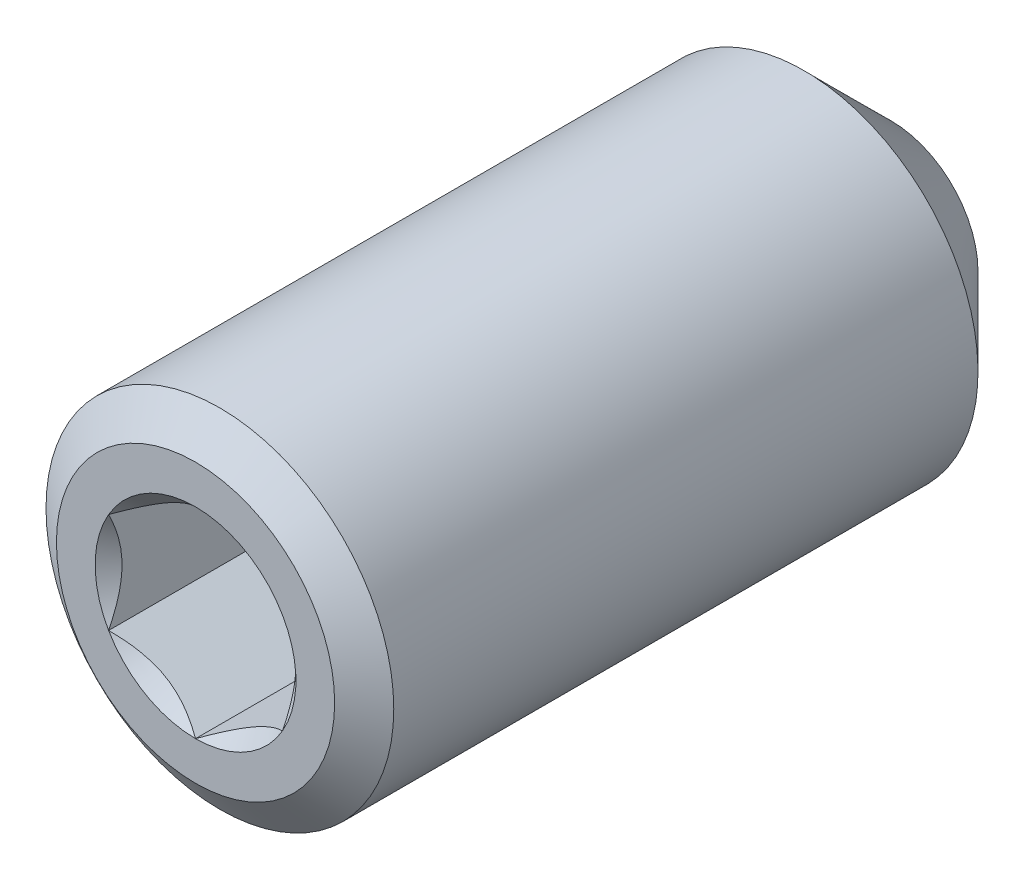
ISO-10303-21;
HEADER;
FILE_DESCRIPTION(('STEP AP214'),'2;1');
FILE_NAME('part.step','',(''),(''),'','','');
FILE_SCHEMA(('AUTOMOTIVE_DESIGN { 1 0 10303 214 1 1 1 1 }'));
ENDSEC;
DATA;
#1=APPLICATION_CONTEXT('core data for automotive mechanical design processes');
#2=APPLICATION_PROTOCOL_DEFINITION('international standard','automotive_design',2000,#1);
#3=PRODUCT_CONTEXT('',#1,'mechanical');
#4=PRODUCT('Part','Part','',(#3));
#5=PRODUCT_RELATED_PRODUCT_CATEGORY('part','',(#4));
#6=PRODUCT_DEFINITION_FORMATION('','',#4);
#7=PRODUCT_DEFINITION_CONTEXT('part definition',#1,'design');
#8=PRODUCT_DEFINITION('design','',#6,#7);
#9=PRODUCT_DEFINITION_SHAPE('','',#8);
#10=(LENGTH_UNIT() NAMED_UNIT(*) SI_UNIT(.MILLI.,.METRE.));
#11=(NAMED_UNIT(*) PLANE_ANGLE_UNIT() SI_UNIT($,.RADIAN.));
#12=(NAMED_UNIT(*) SI_UNIT($,.STERADIAN.) SOLID_ANGLE_UNIT());
#13=UNCERTAINTY_MEASURE_WITH_UNIT(LENGTH_MEASURE(1.E-05),#10,'distance_accuracy_value','');
#14=(GEOMETRIC_REPRESENTATION_CONTEXT(3) GLOBAL_UNCERTAINTY_ASSIGNED_CONTEXT((#13)) GLOBAL_UNIT_ASSIGNED_CONTEXT((#10,
#11,#12)) REPRESENTATION_CONTEXT('',''));
#15=CARTESIAN_POINT('',(0.,0.,0.));
#16=DIRECTION('',(0.,0.,1.));
#17=DIRECTION('',(1.,0.,0.));
#18=AXIS2_PLACEMENT_3D('',#15,#16,#17);
#19=CARTESIAN_POINT('',(0.,0.,4.50000000000727));
#20=DIRECTION('',(0.,0.,1.));
#21=DIRECTION('',(1.,0.,0.));
#22=AXIS2_PLACEMENT_3D('',#19,#20,#21);
#23=CONICAL_SURFACE('',#22,0.749999999925421,1.02974425866182);
#24=CARTESIAN_POINT('',(0.,0.,4.04935453576627));
#25=VERTEX_POINT('',#24);
#26=VERTEX_LOOP('',#25);
#27=FACE_BOUND('',#26,.T.);
#28=CARTESIAN_POINT('',(0.,0.,4.50000000000727));
#29=DIRECTION('',(0.,0.,1.));
#30=DIRECTION('',(1.,0.,0.));
#31=AXIS2_PLACEMENT_3D('',#28,#29,#30);
#32=CIRCLE('',#31,0.749999999925421);
#33=CARTESIAN_POINT('',(0.74999999996271,0.,4.50000000000338));
#34=VERTEX_POINT('',#33);
#35=CARTESIAN_POINT('',(0.374999999981353,-0.64951905280604,4.50000000000338));
#36=VERTEX_POINT('',#35);
#37=EDGE_CURVE('E132',#34,#36,#32,.F.);
#38=ORIENTED_EDGE('',*,*,#37,.F.);
#39=CARTESIAN_POINT('',(0.,0.,4.50000000000727));
#40=DIRECTION('',(0.,0.,1.));
#41=DIRECTION('',(1.,0.,0.));
#42=AXIS2_PLACEMENT_3D('',#39,#40,#41);
#43=CIRCLE('',#42,0.749999999925421);
#44=CARTESIAN_POINT('',(0.374999999981358,0.649519052806031,4.50000000000338));
#45=VERTEX_POINT('',#44);
#46=EDGE_CURVE('E150',#45,#34,#43,.F.);
#47=ORIENTED_EDGE('',*,*,#46,.F.);
#48=CARTESIAN_POINT('',(0.,0.,4.50000000000727));
#49=DIRECTION('',(0.,0.,1.));
#50=DIRECTION('',(1.,0.,0.));
#51=AXIS2_PLACEMENT_3D('',#48,#49,#50);
#52=CIRCLE('',#51,0.749999999925421);
#53=CARTESIAN_POINT('',(-0.374999999981358,0.649519052806032,4.50000000000338));
#54=VERTEX_POINT('',#53);
#55=EDGE_CURVE('E223',#54,#45,#52,.F.);
#56=ORIENTED_EDGE('',*,*,#55,.F.);
#57=CARTESIAN_POINT('',(0.,0.,4.50000000000727));
#58=DIRECTION('',(0.,0.,1.));
#59=DIRECTION('',(1.,0.,0.));
#60=AXIS2_PLACEMENT_3D('',#57,#58,#59);
#61=CIRCLE('',#60,0.749999999925421);
#62=CARTESIAN_POINT('',(-0.749999999962711,0.,4.50000000000338));
#63=VERTEX_POINT('',#62);
#64=EDGE_CURVE('E112',#63,#54,#61,.F.);
#65=ORIENTED_EDGE('',*,*,#64,.F.);
#66=CARTESIAN_POINT('',(0.,0.,4.50000000000727));
#67=DIRECTION('',(0.,0.,1.));
#68=DIRECTION('',(1.,0.,0.));
#69=AXIS2_PLACEMENT_3D('',#66,#67,#68);
#70=CIRCLE('',#69,0.749999999925421);
#71=CARTESIAN_POINT('',(-0.374999999981354,-0.649519052806039,4.50000000000338));
#72=VERTEX_POINT('',#71);
#73=EDGE_CURVE('E106',#72,#63,#70,.F.);
#74=ORIENTED_EDGE('',*,*,#73,.F.);
#75=CARTESIAN_POINT('',(0.,0.,4.50000000000727));
#76=DIRECTION('',(0.,0.,1.));
#77=DIRECTION('',(1.,0.,0.));
#78=AXIS2_PLACEMENT_3D('',#75,#76,#77);
#79=CIRCLE('',#78,0.749999999925421);
#80=EDGE_CURVE('E109',#36,#72,#79,.F.);
#81=ORIENTED_EDGE('',*,*,#80,.F.);
#82=EDGE_LOOP('',(#38,#47,#56,#65,#74,#81));
#83=FACE_BOUND('',#82,.T.);
#84=ADVANCED_FACE('F36',(#27,#83),#23,.F.);
#85=CARTESIAN_POINT('',(0.,0.866025403784442,4.49999999999948));
#86=DIRECTION('',(0.,0.,1.));
#87=DIRECTION('',(1.,0.,0.));
#88=AXIS2_PLACEMENT_3D('',#85,#86,#87);
#89=PLANE('',#88);
#90=DIRECTION('',(0.,-1.,0.));
#91=VECTOR('',#90,1.);
#92=CARTESIAN_POINT('',(-0.75,0.433012701892223,4.49999999999948));
#93=LINE('',#92,#91);
#94=CARTESIAN_POINT('',(-0.750000000000009,-0.433012701892209,4.49999999999948));
#95=VERTEX_POINT('',#94);
#96=EDGE_CURVE('E119',#63,#95,#93,.T.);
#97=ORIENTED_EDGE('',*,*,#96,.T.);
#98=DIRECTION('',(0.866025403784438,-0.500000000000001,0.));
#99=VECTOR('',#98,1.);
#100=CARTESIAN_POINT('',(-0.75,-0.433012701892216,4.49999999999948));
#101=LINE('',#100,#99);
#102=EDGE_CURVE('E117',#95,#72,#101,.T.);
#103=ORIENTED_EDGE('',*,*,#102,.T.);
#104=ORIENTED_EDGE('',*,*,#73,.T.);
#105=EDGE_LOOP('',(#97,#103,#104));
#106=FACE_BOUND('',#105,.T.);
#107=ADVANCED_FACE('F118',(#106),#89,.T.);
#108=CARTESIAN_POINT('',(0.,0.866025403784442,4.49999999999948));
#109=DIRECTION('',(0.,0.,1.));
#110=DIRECTION('',(1.,0.,0.));
#111=AXIS2_PLACEMENT_3D('',#108,#109,#110);
#112=PLANE('',#111);
#113=DIRECTION('',(0.866025403784438,-0.500000000000001,0.));
#114=VECTOR('',#113,1.);
#115=CARTESIAN_POINT('',(-0.75,-0.433012701892216,4.49999999999948));
#116=LINE('',#115,#114);
#117=CARTESIAN_POINT('',(0.,-0.86602540378444,4.49999999999948));
#118=VERTEX_POINT('',#117);
#119=EDGE_CURVE('E124',#72,#118,#116,.T.);
#120=ORIENTED_EDGE('',*,*,#119,.T.);
#121=DIRECTION('',(0.866025403784439,0.5,0.));
#122=VECTOR('',#121,1.);
#123=CARTESIAN_POINT('',(0.,-0.866025403784436,4.49999999999948));
#124=LINE('',#123,#122);
#125=EDGE_CURVE('E130',#118,#36,#124,.T.);
#126=ORIENTED_EDGE('',*,*,#125,.T.);
#127=ORIENTED_EDGE('',*,*,#80,.T.);
#128=EDGE_LOOP('',(#120,#126,#127));
#129=FACE_BOUND('',#128,.T.);
#130=ADVANCED_FACE('F127',(#129),#112,.T.);
#131=CARTESIAN_POINT('',(0.,0.866025403784442,4.49999999999948));
#132=DIRECTION('',(0.,0.,1.));
#133=DIRECTION('',(1.,0.,0.));
#134=AXIS2_PLACEMENT_3D('',#131,#132,#133);
#135=PLANE('',#134);
#136=DIRECTION('',(0.866025403784439,0.5,0.));
#137=VECTOR('',#136,1.);
#138=CARTESIAN_POINT('',(0.,-0.866025403784436,4.49999999999948));
#139=LINE('',#138,#137);
#140=CARTESIAN_POINT('',(0.749999999999999,-0.433012701892217,4.49999999999948));
#141=VERTEX_POINT('',#140);
#142=EDGE_CURVE('E145',#36,#141,#139,.T.);
#143=ORIENTED_EDGE('',*,*,#142,.T.);
#144=DIRECTION('',(0.,1.,0.));
#145=VECTOR('',#144,1.);
#146=CARTESIAN_POINT('',(0.749999999999999,-0.433012701892217,4.49999999999948));
#147=LINE('',#146,#145);
#148=EDGE_CURVE('E146',#141,#34,#147,.T.);
#149=ORIENTED_EDGE('',*,*,#148,.T.);
#150=ORIENTED_EDGE('',*,*,#37,.T.);
#151=EDGE_LOOP('',(#143,#149,#150));
#152=FACE_BOUND('',#151,.T.);
#153=ADVANCED_FACE('F237',(#152),#135,.T.);
#154=CARTESIAN_POINT('',(0.,0.866025403784442,4.49999999999948));
#155=DIRECTION('',(0.,0.,1.));
#156=DIRECTION('',(1.,0.,0.));
#157=AXIS2_PLACEMENT_3D('',#154,#155,#156);
#158=PLANE('',#157);
#159=DIRECTION('',(0.,1.,0.));
#160=VECTOR('',#159,1.);
#161=CARTESIAN_POINT('',(0.749999999999999,-0.433012701892217,4.49999999999948));
#162=LINE('',#161,#160);
#163=CARTESIAN_POINT('',(0.750000000000007,0.433012701892215,4.49999999999948));
#164=VERTEX_POINT('',#163);
#165=EDGE_CURVE('E149',#34,#164,#162,.T.);
#166=ORIENTED_EDGE('',*,*,#165,.T.);
#167=DIRECTION('',(-0.866025403784438,0.5,0.));
#168=VECTOR('',#167,1.);
#169=CARTESIAN_POINT('',(0.749999999999999,0.433012701892222,4.49999999999948));
#170=LINE('',#169,#168);
#171=EDGE_CURVE('E142',#164,#45,#170,.T.);
#172=ORIENTED_EDGE('',*,*,#171,.T.);
#173=ORIENTED_EDGE('',*,*,#46,.T.);
#174=EDGE_LOOP('',(#166,#172,#173));
#175=FACE_BOUND('',#174,.T.);
#176=ADVANCED_FACE('F232',(#175),#158,.T.);
#177=CARTESIAN_POINT('',(0.749999999999999,-0.433012701892217,4.49999999999948));
#178=DIRECTION('',(1.,0.,0.));
#179=DIRECTION('',(0.,1.,0.));
#180=AXIS2_PLACEMENT_3D('',#177,#178,#179);
#181=PLANE('',#180);
#182=CARTESIAN_POINT('',(0.749999999995906,0.433012701914364,5.99999999996046));
#183=CARTESIAN_POINT('',(0.749999999998594,0.403441408888391,5.98522820573675));
#184=CARTESIAN_POINT('',(0.749999999999638,0.37337887783879,5.97131887836901));
#185=CARTESIAN_POINT('',(0.750000000000363,0.312066927955883,5.94582279647847));
#186=CARTESIAN_POINT('',(0.750000000000036,0.280811134179813,5.93425150803452));
#187=CARTESIAN_POINT('',(0.749999999999962,0.217396113243469,5.91427050126752));
#188=CARTESIAN_POINT('',(0.750000000000214,0.18524034957555,5.90585008318148));
#189=CARTESIAN_POINT('',(0.749999999999784,0.12022426110021,5.89288602800046));
#190=CARTESIAN_POINT('',(0.749999999999105,0.0873664415698819,5.88833040254721));
#191=CARTESIAN_POINT('',(0.750000000000244,0.0453234331292911,5.88528812566378));
#192=CARTESIAN_POINT('',(0.750000000000608,0.0362631205459866,5.88479639312832));
#193=CARTESIAN_POINT('',(0.749999999999391,0.0181361518266818,5.88413890227256));
#194=CARTESIAN_POINT('',(0.749999999997811,0.00906950181756283,5.88397296687396));
#195=CARTESIAN_POINT('',(0.749999999991179,-0.0454965876522435,5.88398276973582));
#196=CARTESIAN_POINT('',(0.749999999997652,-0.0910649400477444,5.8882076503569));
#197=CARTESIAN_POINT('',(0.750000000002359,-0.180995263452349,5.90421405985006));
#198=CARTESIAN_POINT('',(0.750000000000548,-0.225349278846379,5.91603676749379));
#199=CARTESIAN_POINT('',(0.749999999999641,-0.297034326914572,5.94020960252143));
#200=CARTESIAN_POINT('',(0.749999999999821,-0.324935648342745,5.950955654539));
#201=CARTESIAN_POINT('',(0.750000000000176,-0.379681856888471,5.97424598413838));
#202=CARTESIAN_POINT('',(0.750000000000351,-0.406534072509005,5.98677291522191));
#203=CARTESIAN_POINT('',(0.749999999999999,-0.433012701915036,5.99999999995856));
#204=B_SPLINE_CURVE_WITH_KNOTS('',3,(#182,#183,#184,#185,#186,#187,#188,#189,#190,#191,#192,
#193,#194,#195,#196,#197,#198,#199,#200,#201,#202,#203),.UNSPECIFIED.,.F.,.F.,(4,2,2,2,2,2,2,2,
2,2,4),(0.,0.0992348996301591,0.199106167923932,0.298635146301185,0.397854250906614,
0.425070686719632,0.452272325669632,0.588727643245865,0.725928832123817,0.815560498237236,
0.904372346970106),.UNSPECIFIED.);
#205=CARTESIAN_POINT('',(0.750000000021348,0.433012701891416,5.99999999996524));
#206=VERTEX_POINT('',#205);
#207=CARTESIAN_POINT('',(0.750000000009975,-0.433012701897992,5.99999999995868));
#208=VERTEX_POINT('',#207);
#209=EDGE_CURVE('E215',#206,#208,#204,.T.);
#210=ORIENTED_EDGE('',*,*,#209,.F.);
#211=DIRECTION('',(0.,0.,1.));
#212=VECTOR('',#211,1.);
#213=CARTESIAN_POINT('',(0.750000000000011,0.433012701892215,4.49999999999948));
#214=LINE('',#213,#212);
#215=EDGE_CURVE('E285',#206,#164,#214,.F.);
#216=ORIENTED_EDGE('',*,*,#215,.T.);
#217=ORIENTED_EDGE('',*,*,#165,.F.);
#218=ORIENTED_EDGE('',*,*,#148,.F.);
#219=DIRECTION('',(0.,0.,1.));
#220=VECTOR('',#219,1.);
#221=CARTESIAN_POINT('',(0.749999999999999,-0.433012701892217,4.49999999999948));
#222=LINE('',#221,#220);
#223=EDGE_CURVE('E152',#141,#208,#222,.T.);
#224=ORIENTED_EDGE('',*,*,#223,.T.);
#225=EDGE_LOOP('',(#210,#216,#217,#218,#224));
#226=FACE_BOUND('',#225,.T.);
#227=ADVANCED_FACE('F226',(#226),#181,.F.);
#228=CARTESIAN_POINT('',(0.,0.866025403784442,4.49999999999948));
#229=DIRECTION('',(0.,0.,1.));
#230=DIRECTION('',(1.,0.,0.));
#231=AXIS2_PLACEMENT_3D('',#228,#229,#230);
#232=PLANE('',#231);
#233=DIRECTION('',(-0.866025403784438,0.5,0.));
#234=VECTOR('',#233,1.);
#235=CARTESIAN_POINT('',(0.749999999999999,0.433012701892222,4.49999999999948));
#236=LINE('',#235,#234);
#237=CARTESIAN_POINT('',(0.,0.866025403784442,4.49999999999948));
#238=VERTEX_POINT('',#237);
#239=EDGE_CURVE('E289',#45,#238,#236,.T.);
#240=ORIENTED_EDGE('',*,*,#239,.T.);
#241=DIRECTION('',(-0.866025403784439,-0.5,0.));
#242=VECTOR('',#241,1.);
#243=CARTESIAN_POINT('',(0.,0.866025403784442,4.49999999999948));
#244=LINE('',#243,#242);
#245=EDGE_CURVE('E288',#238,#54,#244,.T.);
#246=ORIENTED_EDGE('',*,*,#245,.T.);
#247=ORIENTED_EDGE('',*,*,#55,.T.);
#248=EDGE_LOOP('',(#240,#246,#247));
#249=FACE_BOUND('',#248,.T.);
#250=ADVANCED_FACE('F231',(#249),#232,.T.);
#251=CARTESIAN_POINT('',(0.,0.866025403784442,4.49999999999948));
#252=DIRECTION('',(0.,0.,1.));
#253=DIRECTION('',(1.,0.,0.));
#254=AXIS2_PLACEMENT_3D('',#251,#252,#253);
#255=PLANE('',#254);
#256=DIRECTION('',(-0.866025403784439,-0.5,0.));
#257=VECTOR('',#256,1.);
#258=CARTESIAN_POINT('',(0.,0.866025403784442,4.49999999999948));
#259=LINE('',#258,#257);
#260=CARTESIAN_POINT('',(-0.75,0.433012701892223,4.49999999999948));
#261=VERTEX_POINT('',#260);
#262=EDGE_CURVE('E284',#54,#261,#259,.T.);
#263=ORIENTED_EDGE('',*,*,#262,.T.);
#264=DIRECTION('',(0.,-1.,0.));
#265=VECTOR('',#264,1.);
#266=CARTESIAN_POINT('',(-0.75,0.433012701892223,4.49999999999948));
#267=LINE('',#266,#265);
#268=EDGE_CURVE('E153',#261,#63,#267,.T.);
#269=ORIENTED_EDGE('',*,*,#268,.T.);
#270=ORIENTED_EDGE('',*,*,#64,.T.);
#271=EDGE_LOOP('',(#263,#269,#270));
#272=FACE_BOUND('',#271,.T.);
#273=ADVANCED_FACE('F362',(#272),#255,.T.);
#274=CARTESIAN_POINT('',(-0.75,0.433012701892223,4.49999999999948));
#275=DIRECTION('',(-1.,0.,0.));
#276=DIRECTION('',(0.,-1.,0.));
#277=AXIS2_PLACEMENT_3D('',#274,#275,#276);
#278=PLANE('',#277);
#279=CARTESIAN_POINT('',(-0.749999999999923,0.433012701922721,5.99999999996244));
#280=CARTESIAN_POINT('',(-0.749999999999973,0.403246944989505,5.98513147472453));
#281=CARTESIAN_POINT('',(-0.749999999999993,0.372983565897345,5.97113627517712));
#282=CARTESIAN_POINT('',(-0.750000000000008,0.311273429792204,5.94551165761261));
#283=CARTESIAN_POINT('',(-0.750000000000002,0.279820807346284,5.93389649243577));
#284=CARTESIAN_POINT('',(-0.749999999999998,0.216398013159877,5.91399978020333));
#285=CARTESIAN_POINT('',(-0.75,0.184443986521106,5.90566823436392));
#286=CARTESIAN_POINT('',(-0.750000000000001,0.119833147118933,5.89283136511692));
#287=CARTESIAN_POINT('',(-0.75,0.087178305495629,5.88831646481291));
#288=CARTESIAN_POINT('',(-0.75,0.0308931041092522,5.88424416349984));
#289=CARTESIAN_POINT('',(-0.75,0.00733583721429635,5.88364242512977));
#290=CARTESIAN_POINT('',(-0.75,-0.0397329932701554,5.88465658474378));
#291=CARTESIAN_POINT('',(-0.75,-0.0632445456151731,5.88627297259746));
#292=CARTESIAN_POINT('',(-0.75,-0.133443280558879,5.89434248970702));
#293=CARTESIAN_POINT('',(-0.75,-0.1797810172061,5.90401688109026));
#294=CARTESIAN_POINT('',(-0.75,-0.261074390585046,5.92735326039503));
#295=CARTESIAN_POINT('',(-0.75,-0.296412671254379,5.93978774074377));
#296=CARTESIAN_POINT('',(-0.75,-0.36570624571498,5.96779596368077));
#297=CARTESIAN_POINT('',(-0.75,-0.399665619763367,5.98335948719142));
#298=CARTESIAN_POINT('',(-0.75,-0.433012701922693,5.99999999996239));
#299=B_SPLINE_CURVE_WITH_KNOTS('',3,(#279,#280,#281,#282,#283,#284,#285,#286,#287,#288,#289,
#290,#291,#292,#293,#294,#295,#296,#297,#298),.UNSPECIFIED.,.F.,.F.,(4,2,2,2,2,2,2,2,2,4),(0.,
0.0998872099427302,0.200356156114305,0.299229995132668,0.397854992805662,0.468447345365128,
0.539055290641225,0.680311200470284,0.792547810023111,0.904423654744535),.UNSPECIFIED.);
#300=CARTESIAN_POINT('',(-0.75,0.433012701892222,5.9999999999879));
#301=VERTEX_POINT('',#300);
#302=CARTESIAN_POINT('',(-0.750000000070577,-0.43301270186671,5.99999999999552));
#303=VERTEX_POINT('',#302);
#304=EDGE_CURVE('E281',#301,#303,#299,.T.);
#305=ORIENTED_EDGE('',*,*,#304,.T.);
#306=DIRECTION('',(0.,0.,1.));
#307=VECTOR('',#306,1.);
#308=CARTESIAN_POINT('',(-0.750000000000013,-0.433012701892209,4.49999999999948));
#309=LINE('',#308,#307);
#310=EDGE_CURVE('E137',#303,#95,#309,.F.);
#311=ORIENTED_EDGE('',*,*,#310,.T.);
#312=ORIENTED_EDGE('',*,*,#96,.F.);
#313=ORIENTED_EDGE('',*,*,#268,.F.);
#314=DIRECTION('',(0.,0.,1.));
#315=VECTOR('',#314,1.);
#316=CARTESIAN_POINT('',(-0.75,0.433012701892222,4.49999999999948));
#317=LINE('',#316,#315);
#318=EDGE_CURVE('E282',#261,#301,#317,.T.);
#319=ORIENTED_EDGE('',*,*,#318,.T.);
#320=EDGE_LOOP('',(#305,#311,#312,#313,#319));
#321=FACE_BOUND('',#320,.T.);
#322=ADVANCED_FACE('F323',(#321),#278,.F.);
#323=CARTESIAN_POINT('',(-0.75,-0.433012701892216,4.49999999999948));
#324=DIRECTION('',(-0.500000000000001,-0.866025403784438,0.));
#325=DIRECTION('',(0.866025403784438,-0.500000000000001,0.));
#326=AXIS2_PLACEMENT_3D('',#323,#324,#325);
#327=PLANE('',#326);
#328=CARTESIAN_POINT('',(-0.750000000026376,-0.433012701876903,5.99999999996244));
#329=CARTESIAN_POINT('',(-0.724222098348532,-0.447895580349805,5.9851314747255));
#330=CARTESIAN_POINT('',(-0.698013243239477,-0.463027269902192,5.97113627517958));
#331=CARTESIAN_POINT('',(-0.644570697679657,-0.493882337967349,5.94551165761944));
#332=CARTESIAN_POINT('',(-0.617331927614965,-0.509608649196587,5.93389649244547));
#333=CARTESIAN_POINT('',(-0.562406176649344,-0.541320046302027,5.91399978022048));
#334=CARTESIAN_POINT('',(-0.534733177816652,-0.557297059627367,5.90566823438559));
#335=CARTESIAN_POINT('',(-0.478778549514438,-0.589602479340057,5.89283136514922));
#336=CARTESIAN_POINT('',(-0.450498627102313,-0.605929900157359,5.8883164648513));
#337=CARTESIAN_POINT('',(-0.401754212821907,-0.634072500863641,5.88424416354908));
#338=CARTESIAN_POINT('',(-0.38135302123402,-0.645851134318697,5.8836424251842));
#339=CARTESIAN_POINT('',(-0.340590218282302,-0.669385549575796,5.88465658481027));
#340=CARTESIAN_POINT('',(-0.320228616656475,-0.681141325755599,5.88627297267082));
#341=CARTESIAN_POINT('',(-0.25943472884466,-0.716240693248834,5.89434248980279));
#342=CARTESIAN_POINT('',(-0.219305071730786,-0.739409561586017,5.90401688120336));
#343=CARTESIAN_POINT('',(-0.14890294525298,-0.7800562482595,5.92735326051767));
#344=CARTESIAN_POINT('',(-0.118299096515651,-0.797725388566235,5.9397877408492));
#345=CARTESIAN_POINT('',(-0.058289100806435,-0.83237217574302,5.96779596373976));
#346=CARTESIAN_POINT('',(-0.0288794202282302,-0.849351862741627,5.98335948722117));
#347=CARTESIAN_POINT('',(2.18249680749525E-11,-0.866025403797037,5.99999999995975));
#348=B_SPLINE_CURVE_WITH_KNOTS('',3,(#328,#329,#330,#331,#332,#333,#334,#335,#336,#337,#338,
#339,#340,#341,#342,#343,#344,#345,#346,#347),.UNSPECIFIED.,.F.,.F.,(4,2,2,2,2,2,2,2,2,4),(0.,
0.0998872099750245,0.200356156178901,0.299229995228299,0.397854992932302,0.468447345536717,
0.539055290857816,0.680311200776961,0.792547810155694,0.904423654702465),.UNSPECIFIED.);
#349=CARTESIAN_POINT('',(-1.03375332118698E-11,-0.866025403803119,5.99999999996583));
#350=VERTEX_POINT('',#349);
#351=EDGE_CURVE('E318',#303,#350,#348,.T.);
#352=ORIENTED_EDGE('',*,*,#351,.T.);
#353=DIRECTION('',(0.,0.,1.));
#354=VECTOR('',#353,1.);
#355=CARTESIAN_POINT('',(0.,-0.866025403784444,4.49999999999948));
#356=LINE('',#355,#354);
#357=EDGE_CURVE('E136',#350,#118,#356,.F.);
#358=ORIENTED_EDGE('',*,*,#357,.T.);
#359=ORIENTED_EDGE('',*,*,#119,.F.);
#360=ORIENTED_EDGE('',*,*,#102,.F.);
#361=ORIENTED_EDGE('',*,*,#310,.F.);
#362=EDGE_LOOP('',(#352,#358,#359,#360,#361));
#363=FACE_BOUND('',#362,.T.);
#364=ADVANCED_FACE('F134',(#363),#327,.F.);
#365=CARTESIAN_POINT('',(0.,-0.866025403784436,4.49999999999948));
#366=DIRECTION('',(0.5,-0.866025403784439,0.));
#367=DIRECTION('',(0.866025403784439,0.5,0.));
#368=AXIS2_PLACEMENT_3D('',#365,#366,#367);
#369=PLANE('',#368);
#370=CARTESIAN_POINT('',(-2.29217745738725E-11,-0.866025403794427,5.99999999996111));
#371=CARTESIAN_POINT('',(0.0257779016551914,-0.851142525323501,5.98513147472372));
#372=CARTESIAN_POINT('',(0.0519867567641449,-0.836010835772048,5.9711362751778));
#373=CARTESIAN_POINT('',(0.105429302323397,-0.805155767707863,5.94551165761802));
#374=CARTESIAN_POINT('',(0.13266807238762,-0.789429456478659,5.93389649244442));
#375=CARTESIAN_POINT('',(0.18759382335236,-0.757718059373557,5.91399978021998));
#376=CARTESIAN_POINT('',(0.21526682218464,-0.741741046048517,5.90566823438527));
#377=CARTESIAN_POINT('',(0.271221450485992,-0.709435626336369,5.89283136514915));
#378=CARTESIAN_POINT('',(0.299501372897668,-0.69310820551931,5.88831646485133));
#379=CARTESIAN_POINT('',(0.348245787177574,-0.664965604813307,5.88424416354911));
#380=CARTESIAN_POINT('',(0.368646978765414,-0.653186971358281,5.88364242518421));
#381=CARTESIAN_POINT('',(0.409409781717037,-0.62965255610124,5.88465658481023));
#382=CARTESIAN_POINT('',(0.429771383342817,-0.617896779921463,5.88627297267075));
#383=CARTESIAN_POINT('',(0.490565271154505,-0.5827974124283,5.89434248980262));
#384=CARTESIAN_POINT('',(0.530694928268304,-0.559628544091161,5.90401688120311));
#385=CARTESIAN_POINT('',(0.601097054745832,-0.518981857417839,5.92735326051722));
#386=CARTESIAN_POINT('',(0.631700903482961,-0.501312717111219,5.93978774084862));
#387=CARTESIAN_POINT('',(0.691710899191783,-0.466665929934662,5.96779596373886));
#388=CARTESIAN_POINT('',(0.721120579769794,-0.449686242936166,5.9833594872201));
#389=CARTESIAN_POINT('',(0.750000000019662,-0.433012701880865,5.9999999999585));
#390=B_SPLINE_CURVE_WITH_KNOTS('',3,(#370,#371,#372,#373,#374,#375,#376,#377,#378,#379,#380,
#381,#382,#383,#384,#385,#386,#387,#388,#389),.UNSPECIFIED.,.F.,.F.,(4,2,2,2,2,2,2,2,2,4),(0.,
0.0998872099735178,0.200356156175802,0.299229995223615,0.397854992926072,0.46844734553032,
0.539055290851252,0.680311200770097,0.79254781014804,0.904423654693987),.UNSPECIFIED.);
#391=EDGE_CURVE('E340',#350,#208,#390,.T.);
#392=ORIENTED_EDGE('',*,*,#391,.T.);
#393=ORIENTED_EDGE('',*,*,#223,.F.);
#394=ORIENTED_EDGE('',*,*,#142,.F.);
#395=ORIENTED_EDGE('',*,*,#125,.F.);
#396=ORIENTED_EDGE('',*,*,#357,.F.);
#397=EDGE_LOOP('',(#392,#393,#394,#395,#396));
#398=FACE_BOUND('',#397,.T.);
#399=ADVANCED_FACE('F353',(#398),#369,.F.);
#400=CARTESIAN_POINT('',(0.749999999999999,0.433012701892222,4.49999999999948));
#401=DIRECTION('',(0.5,0.866025403784438,0.));
#402=DIRECTION('',(-0.866025403784438,0.5,0.));
#403=AXIS2_PLACEMENT_3D('',#400,#401,#402);
#404=PLANE('',#403);
#405=CARTESIAN_POINT('',(0.750000000017147,0.433012701877584,5.99999999996048));
#406=CARTESIAN_POINT('',(0.724222098341553,0.447895580352165,5.98513147472287));
#407=CARTESIAN_POINT('',(0.698013243233734,0.463027269905063,5.97113627517695));
#408=CARTESIAN_POINT('',(0.644570697675547,0.49388233797018,5.94551165761735));
#409=CARTESIAN_POINT('',(0.617331927611248,0.509608649198859,5.93389649244392));
#410=CARTESIAN_POINT('',(0.562406176646712,0.541320046303433,5.91399978021973));
#411=CARTESIAN_POINT('',(0.534733177814708,0.557297059628464,5.90566823438511));
#412=CARTESIAN_POINT('',(0.478778549513826,0.589602479340447,5.89283136514912));
#413=CARTESIAN_POINT('',(0.450498627102344,0.605929900157353,5.88831646485134));
#414=CARTESIAN_POINT('',(0.401754212822667,0.634072500863203,5.88424416354912));
#415=CARTESIAN_POINT('',(0.381353021234855,0.645851134318219,5.88364242518422));
#416=CARTESIAN_POINT('',(0.340590218283281,0.669385549575237,5.88465658481021));
#417=CARTESIAN_POINT('',(0.320228616657524,0.681141325754999,5.88627297267072));
#418=CARTESIAN_POINT('',(0.259434728845893,0.716240693248126,5.89434248980255));
#419=CARTESIAN_POINT('',(0.219305071732128,0.739409561585247,5.904016881203));
#420=CARTESIAN_POINT('',(0.148902945254154,0.780056248258828,5.92735326051721));
#421=CARTESIAN_POINT('',(0.118299096516564,0.797725388565714,5.93978774084881));
#422=CARTESIAN_POINT('',(0.0582891008068609,0.832372175742779,5.96779596373953));
#423=CARTESIAN_POINT('',(0.0288794202284298,0.849351862741517,5.98335948722106));
#424=CARTESIAN_POINT('',(-2.18417126643851E-11,0.866025403797052,5.99999999995976));
#425=B_SPLINE_CURVE_WITH_KNOTS('',3,(#405,#406,#407,#408,#409,#410,#411,#412,#413,#414,#415,
#416,#417,#418,#419,#420,#421,#422,#423,#424),.UNSPECIFIED.,.F.,.F.,(4,2,2,2,2,2,2,2,2,4),(0.,
0.0998872099728148,0.200356156174355,0.299229995221407,0.397854992923121,0.468447345527287,
0.539055290848137,0.680311200766846,0.792547810146488,0.904423654694103),.UNSPECIFIED.);
#426=CARTESIAN_POINT('',(1.03276667386728E-11,0.866025403803129,5.99999999996584));
#427=VERTEX_POINT('',#426);
#428=EDGE_CURVE('E184',#206,#427,#425,.T.);
#429=ORIENTED_EDGE('',*,*,#428,.T.);
#430=DIRECTION('',(0.,0.,1.));
#431=VECTOR('',#430,1.);
#432=CARTESIAN_POINT('',(0.,0.866025403784442,4.49999999999948));
#433=LINE('',#432,#431);
#434=EDGE_CURVE('E278',#427,#238,#433,.F.);
#435=ORIENTED_EDGE('',*,*,#434,.T.);
#436=ORIENTED_EDGE('',*,*,#239,.F.);
#437=ORIENTED_EDGE('',*,*,#171,.F.);
#438=ORIENTED_EDGE('',*,*,#215,.F.);
#439=EDGE_LOOP('',(#429,#435,#436,#437,#438));
#440=FACE_BOUND('',#439,.T.);
#441=ADVANCED_FACE('F306',(#440),#404,.F.);
#442=CARTESIAN_POINT('',(0.,0.866025403784442,4.49999999999948));
#443=DIRECTION('',(-0.5,0.866025403784439,0.));
#444=DIRECTION('',(-0.866025403784439,-0.5,0.));
#445=AXIS2_PLACEMENT_3D('',#442,#443,#444);
#446=PLANE('',#445);
#447=CARTESIAN_POINT('',(2.29066748437515E-11,0.866025403794433,5.9999999999611));
#448=CARTESIAN_POINT('',(-0.0257779016552101,0.851142525323499,5.98513147472371));
#449=CARTESIAN_POINT('',(-0.0519867567641684,0.836010835772041,5.97113627517779));
#450=CARTESIAN_POINT('',(-0.105429302323431,0.805155767707849,5.94551165761801));
#451=CARTESIAN_POINT('',(-0.13266807238766,0.789429456478642,5.93389649244441));
#452=CARTESIAN_POINT('',(-0.1875938233524,0.757718059373541,5.91399978021997));
#453=CARTESIAN_POINT('',(-0.215266822184673,0.741741046048504,5.90566823438526));
#454=CARTESIAN_POINT('',(-0.271221450486012,0.709435626336364,5.89283136514915));
#455=CARTESIAN_POINT('',(-0.299501372897681,0.693108205519309,5.88831646485133));
#456=CARTESIAN_POINT('',(-0.348245787177578,0.664965604813311,5.88424416354911));
#457=CARTESIAN_POINT('',(-0.368646978765416,0.653186971358286,5.88364242518421));
#458=CARTESIAN_POINT('',(-0.409409781717035,0.629652556101247,5.88465658481023));
#459=CARTESIAN_POINT('',(-0.429771383342812,0.617896779921472,5.88627297267075));
#460=CARTESIAN_POINT('',(-0.490565271154502,0.582797412428308,5.89434248980262));
#461=CARTESIAN_POINT('',(-0.530694928268306,0.559628544091166,5.90401688120312));
#462=CARTESIAN_POINT('',(-0.601097054747048,0.518981857417143,5.92735326051763));
#463=CARTESIAN_POINT('',(-0.631700903485342,0.50131271710985,5.93978774084959));
#464=CARTESIAN_POINT('',(-0.691710899196404,0.466665929932,5.96779596374116));
#465=CARTESIAN_POINT('',(-0.72112057977549,0.449686242932884,5.98335948722317));
#466=CARTESIAN_POINT('',(-0.750000000026392,0.433012701876985,5.99999999996239));
#467=B_SPLINE_CURVE_WITH_KNOTS('',3,(#447,#448,#449,#450,#451,#452,#453,#454,#455,#456,#457,
#458,#459,#460,#461,#462,#463,#464,#465,#466),.UNSPECIFIED.,.F.,.F.,(4,2,2,2,2,2,2,2,2,4),(0.,
0.099887209973538,0.200356156175842,0.29922999522363,0.397854992926063,0.468447345530304,
0.539055290851228,0.680311200770089,0.792547810152384,0.904423654702651),.UNSPECIFIED.);
#468=EDGE_CURVE('E176',#427,#301,#467,.T.);
#469=ORIENTED_EDGE('',*,*,#468,.T.);
#470=ORIENTED_EDGE('',*,*,#318,.F.);
#471=ORIENTED_EDGE('',*,*,#262,.F.);
#472=ORIENTED_EDGE('',*,*,#245,.F.);
#473=ORIENTED_EDGE('',*,*,#434,.F.);
#474=EDGE_LOOP('',(#469,#470,#471,#472,#473));
#475=FACE_BOUND('',#474,.T.);
#476=ADVANCED_FACE('F191',(#475),#446,.F.);
#477=CARTESIAN_POINT('',(0.,0.,5.99999999991496));
#478=DIRECTION('',(0.,0.,1.));
#479=DIRECTION('',(1.,0.,0.));
#480=AXIS2_PLACEMENT_3D('',#477,#478,#479);
#481=CONICAL_SURFACE('',#480,0.866025403752246,0.785398163397448);
#482=ORIENTED_EDGE('',*,*,#304,.F.);
#483=CARTESIAN_POINT('',(0.,0.,6.00000000002864));
#484=DIRECTION('',(0.,0.,1.));
#485=DIRECTION('',(1.,0.,0.));
#486=AXIS2_PLACEMENT_3D('',#483,#484,#485);
#487=CIRCLE('',#486,0.866025403865933);
#488=EDGE_CURVE('E173',#301,#303,#487,.T.);
#489=ORIENTED_EDGE('',*,*,#488,.T.);
#490=EDGE_LOOP('',(#482,#489));
#491=FACE_BOUND('',#490,.T.);
#492=ADVANCED_FACE('F325',(#491),#481,.F.);
#493=CARTESIAN_POINT('',(0.,0.,5.99999999991496));
#494=DIRECTION('',(0.,0.,1.));
#495=DIRECTION('',(1.,0.,0.));
#496=AXIS2_PLACEMENT_3D('',#493,#494,#495);
#497=CONICAL_SURFACE('',#496,0.866025403752246,0.785398163640696);
#498=ORIENTED_EDGE('',*,*,#351,.F.);
#499=CARTESIAN_POINT('',(0.,0.,5.9999999999718));
#500=DIRECTION('',(0.,0.,1.));
#501=DIRECTION('',(1.,0.,0.));
#502=AXIS2_PLACEMENT_3D('',#499,#500,#501);
#503=CIRCLE('',#502,0.86602540380909);
#504=EDGE_CURVE('E170',#303,#350,#503,.T.);
#505=ORIENTED_EDGE('',*,*,#504,.T.);
#506=EDGE_LOOP('',(#498,#505));
#507=FACE_BOUND('',#506,.T.);
#508=ADVANCED_FACE('F328',(#507),#497,.F.);
#509=CARTESIAN_POINT('',(0.,0.,5.99999999991496));
#510=DIRECTION('',(0.,0.,1.));
#511=DIRECTION('',(1.,0.,0.));
#512=AXIS2_PLACEMENT_3D('',#509,#510,#511);
#513=CONICAL_SURFACE('',#512,0.866025403752246,0.785398163640696);
#514=ORIENTED_EDGE('',*,*,#391,.F.);
#515=CARTESIAN_POINT('',(0.,0.,5.9999999999718));
#516=DIRECTION('',(0.,0.,1.));
#517=DIRECTION('',(1.,0.,0.));
#518=AXIS2_PLACEMENT_3D('',#515,#516,#517);
#519=CIRCLE('',#518,0.86602540380909);
#520=EDGE_CURVE('E167',#350,#208,#519,.T.);
#521=ORIENTED_EDGE('',*,*,#520,.T.);
#522=EDGE_LOOP('',(#514,#521));
#523=FACE_BOUND('',#522,.T.);
#524=ADVANCED_FACE('F210',(#523),#513,.F.);
#525=CARTESIAN_POINT('',(0.,0.,5.99999999991496));
#526=DIRECTION('',(0.,0.,1.));
#527=DIRECTION('',(1.,0.,0.));
#528=AXIS2_PLACEMENT_3D('',#525,#526,#527);
#529=CONICAL_SURFACE('',#528,0.866025403752246,0.785398163640948);
#530=CARTESIAN_POINT('',(0.,0.,5.9999999999718));
#531=DIRECTION('',(0.,0.,1.));
#532=DIRECTION('',(1.,0.,0.));
#533=AXIS2_PLACEMENT_3D('',#530,#531,#532);
#534=CIRCLE('',#533,0.86602540380909);
#535=EDGE_CURVE('E164',#208,#206,#534,.T.);
#536=ORIENTED_EDGE('',*,*,#535,.T.);
#537=ORIENTED_EDGE('',*,*,#209,.T.);
#538=EDGE_LOOP('',(#536,#537));
#539=FACE_BOUND('',#538,.T.);
#540=ADVANCED_FACE('F205',(#539),#529,.F.);
#541=CARTESIAN_POINT('',(0.,0.,5.99999999991496));
#542=DIRECTION('',(0.,0.,1.));
#543=DIRECTION('',(1.,0.,0.));
#544=AXIS2_PLACEMENT_3D('',#541,#542,#543);
#545=CONICAL_SURFACE('',#544,0.866025403752246,0.785398163640696);
#546=ORIENTED_EDGE('',*,*,#428,.F.);
#547=CARTESIAN_POINT('',(0.,0.,5.9999999999718));
#548=DIRECTION('',(0.,0.,1.));
#549=DIRECTION('',(1.,0.,0.));
#550=AXIS2_PLACEMENT_3D('',#547,#548,#549);
#551=CIRCLE('',#550,0.86602540380909);
#552=EDGE_CURVE('E161',#206,#427,#551,.T.);
#553=ORIENTED_EDGE('',*,*,#552,.T.);
#554=EDGE_LOOP('',(#546,#553));
#555=FACE_BOUND('',#554,.T.);
#556=ADVANCED_FACE('F199',(#555),#545,.F.);
#557=CARTESIAN_POINT('',(0.,0.,5.99999999991496));
#558=DIRECTION('',(0.,0.,1.));
#559=DIRECTION('',(1.,0.,0.));
#560=AXIS2_PLACEMENT_3D('',#557,#558,#559);
#561=CONICAL_SURFACE('',#560,0.866025403752246,0.785398163640696);
#562=ORIENTED_EDGE('',*,*,#468,.F.);
#563=CARTESIAN_POINT('',(0.,0.,5.9999999999718));
#564=DIRECTION('',(0.,0.,1.));
#565=DIRECTION('',(1.,0.,0.));
#566=AXIS2_PLACEMENT_3D('',#563,#564,#565);
#567=CIRCLE('',#566,0.86602540380909);
#568=EDGE_CURVE('E158',#427,#301,#567,.T.);
#569=ORIENTED_EDGE('',*,*,#568,.T.);
#570=EDGE_LOOP('',(#562,#569));
#571=FACE_BOUND('',#570,.T.);
#572=ADVANCED_FACE('F194',(#571),#561,.F.);
#573=CARTESIAN_POINT('',(0.,0.,5.99999999999948));
#574=DIRECTION('',(0.,0.,-1.));
#575=DIRECTION('',(0.,1.,0.));
#576=AXIS2_PLACEMENT_3D('',#573,#574,#575);
#577=PLANE('',#576);
#578=CARTESIAN_POINT('',(0.,0.,6.0000000000059));
#579=DIRECTION('',(0.,0.,-1.));
#580=DIRECTION('',(0.,1.,0.));
#581=AXIS2_PLACEMENT_3D('',#578,#579,#580);
#582=CIRCLE('',#581,1.20000000009668);
#583=CARTESIAN_POINT('',(0.,1.20000000009666,6.00000000000591));
#584=VERTEX_POINT('',#583);
#585=EDGE_CURVE('E155',#584,#584,#582,.T.);
#586=ORIENTED_EDGE('',*,*,#585,.F.);
#587=EDGE_LOOP('',(#586));
#588=FACE_BOUND('',#587,.T.);
#589=ORIENTED_EDGE('',*,*,#552,.F.);
#590=ORIENTED_EDGE('',*,*,#535,.F.);
#591=ORIENTED_EDGE('',*,*,#520,.F.);
#592=ORIENTED_EDGE('',*,*,#504,.F.);
#593=ORIENTED_EDGE('',*,*,#488,.F.);
#594=ORIENTED_EDGE('',*,*,#568,.F.);
#595=EDGE_LOOP('',(#589,#590,#591,#592,#593,#594));
#596=FACE_BOUND('',#595,.T.);
#597=ADVANCED_FACE('F198',(#588,#596),#577,.F.);
#598=CARTESIAN_POINT('',(0.,0.,5.78993773865476));
#599=DIRECTION('',(0.,0.,-1.));
#600=DIRECTION('',(0.,1.,0.));
#601=AXIS2_PLACEMENT_3D('',#598,#599,#600);
#602=CONICAL_SURFACE('',#601,1.49999999996456,0.959931088639963);
#603=CARTESIAN_POINT('',(0.,0.,5.78993773853656));
#604=DIRECTION('',(0.,0.,1.));
#605=DIRECTION('',(0.,-1.,0.));
#606=AXIS2_PLACEMENT_3D('',#603,#604,#605);
#607=CIRCLE('',#606,1.50000000000002);
#608=CARTESIAN_POINT('',(0.,-1.50000000000003,5.78993773853656));
#609=VERTEX_POINT('',#608);
#610=EDGE_CURVE('E39',#609,#609,#607,.F.);
#611=ORIENTED_EDGE('',*,*,#610,.F.);
#612=EDGE_LOOP('',(#611));
#613=FACE_BOUND('',#612,.T.);
#614=ORIENTED_EDGE('',*,*,#585,.T.);
#615=EDGE_LOOP('',(#614));
#616=FACE_BOUND('',#615,.T.);
#617=ADVANCED_FACE('F249',(#613,#616),#602,.T.);
#618=CARTESIAN_POINT('',(0.,0.,-4.52762827229947E-13));
#619=DIRECTION('',(0.,0.,-1.));
#620=DIRECTION('',(0.,1.,0.));
#621=AXIS2_PLACEMENT_3D('',#618,#619,#620);
#622=CONICAL_SURFACE('',#621,0.750000000000028,1.02974425867645);
#623=CARTESIAN_POINT('',(0.,2.4013157136862E-13,0.450645464270312));
#624=VERTEX_POINT('',#623);
#625=VERTEX_LOOP('',#624);
#626=FACE_BOUND('',#625,.T.);
#627=CARTESIAN_POINT('',(0.,0.,0.));
#628=DIRECTION('',(0.,0.,1.));
#629=DIRECTION('',(0.,-1.,0.));
#630=AXIS2_PLACEMENT_3D('',#627,#628,#629);
#631=CIRCLE('',#630,0.750000000039108);
#632=CARTESIAN_POINT('',(0.,-0.75000000003909,0.));
#633=VERTEX_POINT('',#632);
#634=EDGE_CURVE('E11',#633,#633,#631,.T.);
#635=ORIENTED_EDGE('',*,*,#634,.F.);
#636=EDGE_LOOP('',(#635));
#637=FACE_BOUND('',#636,.T.);
#638=ADVANCED_FACE('F248',(#626,#637),#622,.F.);
#639=CARTESIAN_POINT('',(0.,0.,0.750000000039113));
#640=DIRECTION('',(0.,0.,1.));
#641=DIRECTION('',(0.,-1.,0.));
#642=AXIS2_PLACEMENT_3D('',#639,#640,#641);
#643=CONICAL_SURFACE('',#642,1.50000000002137,0.785398163397443);
#644=CARTESIAN_POINT('',(0.,0.,0.749999999999479));
#645=DIRECTION('',(0.,0.,1.));
#646=DIRECTION('',(0.,-1.,0.));
#647=AXIS2_PLACEMENT_3D('',#644,#645,#646);
#648=CIRCLE('',#647,1.50000000000002);
#649=CARTESIAN_POINT('',(0.,-1.5,0.74999999999947));
#650=VERTEX_POINT('',#649);
#651=EDGE_CURVE('E45',#650,#650,#648,.T.);
#652=ORIENTED_EDGE('',*,*,#651,.F.);
#653=EDGE_LOOP('',(#652));
#654=FACE_BOUND('',#653,.T.);
#655=ORIENTED_EDGE('',*,*,#634,.T.);
#656=EDGE_LOOP('',(#655));
#657=FACE_BOUND('',#656,.T.);
#658=ADVANCED_FACE('F256',(#654,#657),#643,.T.);
#659=CARTESIAN_POINT('',(0.,0.,0.450645464270159));
#660=DIRECTION('',(0.,0.,1.));
#661=DIRECTION('',(0.,-1.,0.));
#662=AXIS2_PLACEMENT_3D('',#659,#660,#661);
#663=CYLINDRICAL_SURFACE('',#662,1.50000000000002);
#664=ORIENTED_EDGE('',*,*,#651,.T.);
#665=EDGE_LOOP('',(#664));
#666=FACE_BOUND('',#665,.T.);
#667=ORIENTED_EDGE('',*,*,#610,.T.);
#668=EDGE_LOOP('',(#667));
#669=FACE_BOUND('',#668,.T.);
#670=ADVANCED_FACE('F262',(#666,#669),#663,.T.);
#671=CLOSED_SHELL('',(#84,#107,#130,#153,#176,#227,#250,#273,#322,#364,#399,#441,#476,#492,#508,
#524,#540,#556,#572,#597,#617,#638,#658,#670));
#672=MANIFOLD_SOLID_BREP('B2',#671);
#673=ADVANCED_BREP_SHAPE_REPRESENTATION('',(#18,#672),#14);
#674=SHAPE_DEFINITION_REPRESENTATION(#9,#673);
ENDSEC;
END-ISO-10303-21;
